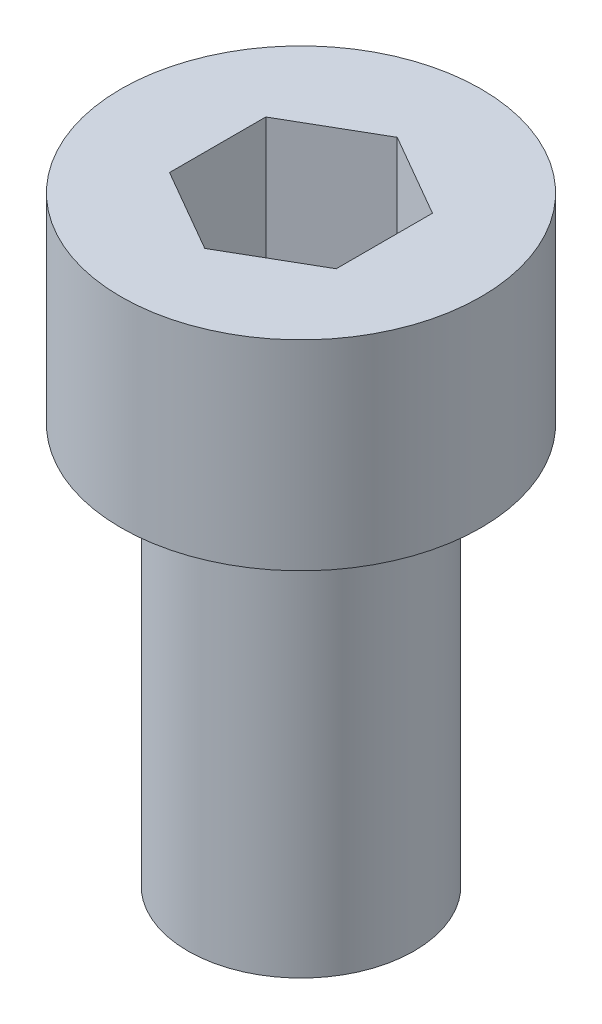
ISO-10303-21;
HEADER;
FILE_DESCRIPTION(('STEP AP214'),'2;1');
FILE_NAME('part.step','',(''),(''),'','','');
FILE_SCHEMA(('AUTOMOTIVE_DESIGN { 1 0 10303 214 1 1 1 1 }'));
ENDSEC;
DATA;
#1=APPLICATION_CONTEXT('core data for automotive mechanical design processes');
#2=APPLICATION_PROTOCOL_DEFINITION('international standard','automotive_design',2000,#1);
#3=PRODUCT_CONTEXT('',#1,'mechanical');
#4=PRODUCT('Part','Part','',(#3));
#5=PRODUCT_RELATED_PRODUCT_CATEGORY('part','',(#4));
#6=PRODUCT_DEFINITION_FORMATION('','',#4);
#7=PRODUCT_DEFINITION_CONTEXT('part definition',#1,'design');
#8=PRODUCT_DEFINITION('design','',#6,#7);
#9=PRODUCT_DEFINITION_SHAPE('','',#8);
#10=(LENGTH_UNIT() NAMED_UNIT(*) SI_UNIT(.MILLI.,.METRE.));
#11=(NAMED_UNIT(*) PLANE_ANGLE_UNIT() SI_UNIT($,.RADIAN.));
#12=(NAMED_UNIT(*) SI_UNIT($,.STERADIAN.) SOLID_ANGLE_UNIT());
#13=UNCERTAINTY_MEASURE_WITH_UNIT(LENGTH_MEASURE(1.E-05),#10,'distance_accuracy_value','');
#14=(GEOMETRIC_REPRESENTATION_CONTEXT(3) GLOBAL_UNCERTAINTY_ASSIGNED_CONTEXT((#13)) GLOBAL_UNIT_ASSIGNED_CONTEXT((#10,
#11,#12)) REPRESENTATION_CONTEXT('',''));
#15=CARTESIAN_POINT('',(0.,0.,0.));
#16=DIRECTION('',(0.,0.,1.));
#17=DIRECTION('',(1.,0.,0.));
#18=AXIS2_PLACEMENT_3D('',#15,#16,#17);
#19=CARTESIAN_POINT('',(184.714490271524,-3.,125.244295140347));
#20=DIRECTION('',(0.,1.,0.));
#21=DIRECTION('',(0.,0.,1.));
#22=AXIS2_PLACEMENT_3D('',#19,#20,#21);
#23=CYLINDRICAL_SURFACE('',#22,2.70000000000001);
#24=CARTESIAN_POINT('',(184.714490271524,-3.,125.244295140347));
#25=DIRECTION('',(0.,1.,0.));
#26=DIRECTION('',(0.,0.,1.));
#27=AXIS2_PLACEMENT_3D('',#24,#25,#26);
#28=CIRCLE('',#27,2.70000000000001);
#29=CARTESIAN_POINT('',(184.714490271524,-3.,127.944295140347));
#30=VERTEX_POINT('',#29);
#31=EDGE_CURVE('E48',#30,#30,#28,.T.);
#32=ORIENTED_EDGE('',*,*,#31,.T.);
#33=EDGE_LOOP('',(#32));
#34=FACE_BOUND('',#33,.T.);
#35=CARTESIAN_POINT('',(184.714490271524,0.,125.244295140347));
#36=DIRECTION('',(0.,1.,0.));
#37=DIRECTION('',(0.,0.,1.));
#38=AXIS2_PLACEMENT_3D('',#35,#36,#37);
#39=CIRCLE('',#38,2.70000000000001);
#40=CARTESIAN_POINT('',(184.714490271524,0.,127.944295140347));
#41=VERTEX_POINT('',#40);
#42=EDGE_CURVE('E42',#41,#41,#39,.T.);
#43=ORIENTED_EDGE('',*,*,#42,.F.);
#44=EDGE_LOOP('',(#43));
#45=FACE_BOUND('',#44,.T.);
#46=ADVANCED_FACE('F39',(#34,#45),#23,.T.);
#47=CARTESIAN_POINT('',(184.714490271524,-3.,125.244295140347));
#48=DIRECTION('',(0.,1.,0.));
#49=DIRECTION('',(0.,0.,1.));
#50=AXIS2_PLACEMENT_3D('',#47,#48,#49);
#51=PLANE('',#50);
#52=CARTESIAN_POINT('',(184.714490271524,-3.,125.244295140347));
#53=DIRECTION('',(0.,-1.,0.));
#54=DIRECTION('',(0.,0.,-1.));
#55=AXIS2_PLACEMENT_3D('',#52,#53,#54);
#56=CIRCLE('',#55,1.69629374220996);
#57=CARTESIAN_POINT('',(184.714490271524,-3.,123.548001398137));
#58=VERTEX_POINT('',#57);
#59=EDGE_CURVE('E11',#58,#58,#56,.T.);
#60=ORIENTED_EDGE('',*,*,#59,.F.);
#61=EDGE_LOOP('',(#60));
#62=FACE_BOUND('',#61,.T.);
#63=ORIENTED_EDGE('',*,*,#31,.F.);
#64=EDGE_LOOP('',(#63));
#65=FACE_BOUND('',#64,.T.);
#66=ADVANCED_FACE('F178',(#62,#65),#51,.F.);
#67=CARTESIAN_POINT('',(184.714490271524,0.,125.244295140347));
#68=DIRECTION('',(0.,1.,0.));
#69=DIRECTION('',(0.,0.,1.));
#70=AXIS2_PLACEMENT_3D('',#67,#68,#69);
#71=PLANE('',#70);
#72=DIRECTION('',(-0.866025403784435,0.,-0.500000000000006));
#73=VECTOR('',#72,1.);
#74=CARTESIAN_POINT('',(185.964490271524,0.,124.52260730386));
#75=LINE('',#74,#73);
#76=CARTESIAN_POINT('',(185.964490271524,0.,124.52260730386));
#77=VERTEX_POINT('',#76);
#78=CARTESIAN_POINT('',(184.714490271524,0.,123.800919467373));
#79=VERTEX_POINT('',#78);
#80=EDGE_CURVE('E56',#77,#79,#75,.T.);
#81=ORIENTED_EDGE('',*,*,#80,.F.);
#82=DIRECTION('',(0.,0.,-1.));
#83=VECTOR('',#82,1.);
#84=CARTESIAN_POINT('',(185.964490271524,0.,125.965982976834));
#85=LINE('',#84,#83);
#86=CARTESIAN_POINT('',(185.964490271524,0.,125.965982976834));
#87=VERTEX_POINT('',#86);
#88=EDGE_CURVE('E149',#87,#77,#85,.T.);
#89=ORIENTED_EDGE('',*,*,#88,.F.);
#90=DIRECTION('',(0.86602540378443,0.,-0.500000000000015));
#91=VECTOR('',#90,1.);
#92=CARTESIAN_POINT('',(184.714490271524,0.,126.687670813321));
#93=LINE('',#92,#91);
#94=CARTESIAN_POINT('',(184.714490271524,0.,126.687670813321));
#95=VERTEX_POINT('',#94);
#96=EDGE_CURVE('E146',#95,#87,#93,.T.);
#97=ORIENTED_EDGE('',*,*,#96,.F.);
#98=DIRECTION('',(0.866025403784436,0.,0.500000000000004));
#99=VECTOR('',#98,1.);
#100=CARTESIAN_POINT('',(183.464490271524,0.,125.965982976834));
#101=LINE('',#100,#99);
#102=CARTESIAN_POINT('',(183.464490271524,0.,125.965982976834));
#103=VERTEX_POINT('',#102);
#104=EDGE_CURVE('E104',#103,#95,#101,.T.);
#105=ORIENTED_EDGE('',*,*,#104,.F.);
#106=DIRECTION('',(0.,0.,1.));
#107=VECTOR('',#106,1.);
#108=CARTESIAN_POINT('',(183.464490271524,0.,124.52260730386));
#109=LINE('',#108,#107);
#110=CARTESIAN_POINT('',(183.464490271524,0.,124.52260730386));
#111=VERTEX_POINT('',#110);
#112=EDGE_CURVE('E140',#111,#103,#109,.T.);
#113=ORIENTED_EDGE('',*,*,#112,.F.);
#114=DIRECTION('',(-0.86602540378444,0.,0.499999999999998));
#115=VECTOR('',#114,1.);
#116=CARTESIAN_POINT('',(184.714490271524,0.,123.800919467373));
#117=LINE('',#116,#115);
#118=EDGE_CURVE('E136',#79,#111,#117,.T.);
#119=ORIENTED_EDGE('',*,*,#118,.F.);
#120=EDGE_LOOP('',(#81,#89,#97,#105,#113,#119));
#121=FACE_BOUND('',#120,.T.);
#122=ORIENTED_EDGE('',*,*,#42,.T.);
#123=EDGE_LOOP('',(#122));
#124=FACE_BOUND('',#123,.T.);
#125=ADVANCED_FACE('F175',(#121,#124),#71,.T.);
#126=CARTESIAN_POINT('',(184.714490271524,-9.,125.244295140347));
#127=DIRECTION('',(0.,1.,0.));
#128=DIRECTION('',(0.,0.,1.));
#129=AXIS2_PLACEMENT_3D('',#126,#127,#128);
#130=CYLINDRICAL_SURFACE('',#129,1.69629374220996);
#131=CARTESIAN_POINT('',(184.714490271524,-9.,125.244295140347));
#132=DIRECTION('',(0.,-1.,0.));
#133=DIRECTION('',(0.,0.,-1.));
#134=AXIS2_PLACEMENT_3D('',#131,#132,#133);
#135=CIRCLE('',#134,1.69629374220996);
#136=CARTESIAN_POINT('',(184.714490271524,-9.,123.548001398137));
#137=VERTEX_POINT('',#136);
#138=EDGE_CURVE('E155',#137,#137,#135,.T.);
#139=ORIENTED_EDGE('',*,*,#138,.F.);
#140=EDGE_LOOP('',(#139));
#141=FACE_BOUND('',#140,.T.);
#142=ORIENTED_EDGE('',*,*,#59,.T.);
#143=EDGE_LOOP('',(#142));
#144=FACE_BOUND('',#143,.T.);
#145=ADVANCED_FACE('F187',(#141,#144),#130,.T.);
#146=CARTESIAN_POINT('',(184.714490271524,-9.,125.244295140347));
#147=DIRECTION('',(0.,-1.,0.));
#148=DIRECTION('',(0.,0.,-1.));
#149=AXIS2_PLACEMENT_3D('',#146,#147,#148);
#150=PLANE('',#149);
#151=ORIENTED_EDGE('',*,*,#138,.T.);
#152=EDGE_LOOP('',(#151));
#153=FACE_BOUND('',#152,.T.);
#154=ADVANCED_FACE('F194',(#153),#150,.T.);
#155=CARTESIAN_POINT('',(185.964490271524,-2.,124.52260730386));
#156=DIRECTION('',(0.500000000000006,0.,-0.866025403784435));
#157=DIRECTION('',(-0.866025403784435,0.,-0.500000000000006));
#158=AXIS2_PLACEMENT_3D('',#155,#156,#157);
#159=PLANE('',#158);
#160=ORIENTED_EDGE('',*,*,#80,.T.);
#161=DIRECTION('',(0.,1.,0.));
#162=VECTOR('',#161,1.);
#163=CARTESIAN_POINT('',(184.714490271524,-2.,123.800919467373));
#164=LINE('',#163,#162);
#165=CARTESIAN_POINT('',(184.714490271524,-2.,123.800919467373));
#166=VERTEX_POINT('',#165);
#167=EDGE_CURVE('E86',#166,#79,#164,.T.);
#168=ORIENTED_EDGE('',*,*,#167,.F.);
#169=DIRECTION('',(-0.866025403784435,0.,-0.500000000000006));
#170=VECTOR('',#169,1.);
#171=CARTESIAN_POINT('',(185.964490271524,-2.,124.52260730386));
#172=LINE('',#171,#170);
#173=CARTESIAN_POINT('',(185.964490271524,-2.,124.52260730386));
#174=VERTEX_POINT('',#173);
#175=EDGE_CURVE('E152',#174,#166,#172,.T.);
#176=ORIENTED_EDGE('',*,*,#175,.F.);
#177=DIRECTION('',(0.,1.,0.));
#178=VECTOR('',#177,1.);
#179=CARTESIAN_POINT('',(185.964490271524,-2.,124.52260730386));
#180=LINE('',#179,#178);
#181=EDGE_CURVE('E64',#174,#77,#180,.T.);
#182=ORIENTED_EDGE('',*,*,#181,.T.);
#183=EDGE_LOOP('',(#160,#168,#176,#182));
#184=FACE_BOUND('',#183,.T.);
#185=ADVANCED_FACE('F198',(#184),#159,.F.);
#186=CARTESIAN_POINT('',(185.964490271524,-2.,125.965982976834));
#187=DIRECTION('',(1.,0.,0.));
#188=DIRECTION('',(0.,0.,-1.));
#189=AXIS2_PLACEMENT_3D('',#186,#187,#188);
#190=PLANE('',#189);
#191=ORIENTED_EDGE('',*,*,#88,.T.);
#192=ORIENTED_EDGE('',*,*,#181,.F.);
#193=DIRECTION('',(0.,0.,-1.));
#194=VECTOR('',#193,1.);
#195=CARTESIAN_POINT('',(185.964490271524,-2.,125.965982976834));
#196=LINE('',#195,#194);
#197=CARTESIAN_POINT('',(185.964490271524,-2.,125.965982976834));
#198=VERTEX_POINT('',#197);
#199=EDGE_CURVE('E118',#198,#174,#196,.T.);
#200=ORIENTED_EDGE('',*,*,#199,.F.);
#201=DIRECTION('',(0.,1.,0.));
#202=VECTOR('',#201,1.);
#203=CARTESIAN_POINT('',(185.964490271524,-2.,125.965982976834));
#204=LINE('',#203,#202);
#205=EDGE_CURVE('E109',#198,#87,#204,.T.);
#206=ORIENTED_EDGE('',*,*,#205,.T.);
#207=EDGE_LOOP('',(#191,#192,#200,#206));
#208=FACE_BOUND('',#207,.T.);
#209=ADVANCED_FACE('F202',(#208),#190,.F.);
#210=CARTESIAN_POINT('',(184.714490271524,-2.,126.687670813321));
#211=DIRECTION('',(0.500000000000015,0.,0.86602540378443));
#212=DIRECTION('',(0.86602540378443,0.,-0.500000000000015));
#213=AXIS2_PLACEMENT_3D('',#210,#211,#212);
#214=PLANE('',#213);
#215=ORIENTED_EDGE('',*,*,#96,.T.);
#216=ORIENTED_EDGE('',*,*,#205,.F.);
#217=DIRECTION('',(0.86602540378443,0.,-0.500000000000015));
#218=VECTOR('',#217,1.);
#219=CARTESIAN_POINT('',(184.714490271524,-2.,126.687670813321));
#220=LINE('',#219,#218);
#221=CARTESIAN_POINT('',(184.714490271524,-2.,126.687670813321));
#222=VERTEX_POINT('',#221);
#223=EDGE_CURVE('E113',#222,#198,#220,.T.);
#224=ORIENTED_EDGE('',*,*,#223,.F.);
#225=DIRECTION('',(0.,1.,0.));
#226=VECTOR('',#225,1.);
#227=CARTESIAN_POINT('',(184.714490271524,-2.,126.687670813321));
#228=LINE('',#227,#226);
#229=EDGE_CURVE('E97',#222,#95,#228,.T.);
#230=ORIENTED_EDGE('',*,*,#229,.T.);
#231=EDGE_LOOP('',(#215,#216,#224,#230));
#232=FACE_BOUND('',#231,.T.);
#233=ADVANCED_FACE('F114',(#232),#214,.F.);
#234=CARTESIAN_POINT('',(183.464490271524,-2.,125.965982976834));
#235=DIRECTION('',(-0.500000000000004,0.,0.866025403784436));
#236=DIRECTION('',(0.866025403784436,0.,0.500000000000004));
#237=AXIS2_PLACEMENT_3D('',#234,#235,#236);
#238=PLANE('',#237);
#239=ORIENTED_EDGE('',*,*,#104,.T.);
#240=ORIENTED_EDGE('',*,*,#229,.F.);
#241=DIRECTION('',(0.866025403784436,0.,0.500000000000004));
#242=VECTOR('',#241,1.);
#243=CARTESIAN_POINT('',(183.464490271524,-2.,125.965982976834));
#244=LINE('',#243,#242);
#245=CARTESIAN_POINT('',(183.464490271524,-2.,125.965982976834));
#246=VERTEX_POINT('',#245);
#247=EDGE_CURVE('E101',#246,#222,#244,.T.);
#248=ORIENTED_EDGE('',*,*,#247,.F.);
#249=DIRECTION('',(0.,1.,0.));
#250=VECTOR('',#249,1.);
#251=CARTESIAN_POINT('',(183.464490271524,-2.,125.965982976834));
#252=LINE('',#251,#250);
#253=EDGE_CURVE('E110',#246,#103,#252,.T.);
#254=ORIENTED_EDGE('',*,*,#253,.T.);
#255=EDGE_LOOP('',(#239,#240,#248,#254));
#256=FACE_BOUND('',#255,.T.);
#257=ADVANCED_FACE('F99',(#256),#238,.F.);
#258=CARTESIAN_POINT('',(183.464490271524,-2.,124.52260730386));
#259=DIRECTION('',(-1.,0.,0.));
#260=DIRECTION('',(0.,0.,1.));
#261=AXIS2_PLACEMENT_3D('',#258,#259,#260);
#262=PLANE('',#261);
#263=ORIENTED_EDGE('',*,*,#112,.T.);
#264=ORIENTED_EDGE('',*,*,#253,.F.);
#265=DIRECTION('',(0.,0.,1.));
#266=VECTOR('',#265,1.);
#267=CARTESIAN_POINT('',(183.464490271524,-2.,124.52260730386));
#268=LINE('',#267,#266);
#269=CARTESIAN_POINT('',(183.464490271524,-2.,124.52260730386));
#270=VERTEX_POINT('',#269);
#271=EDGE_CURVE('E124',#270,#246,#268,.T.);
#272=ORIENTED_EDGE('',*,*,#271,.F.);
#273=DIRECTION('',(0.,1.,0.));
#274=VECTOR('',#273,1.);
#275=CARTESIAN_POINT('',(183.464490271524,-2.,124.52260730386));
#276=LINE('',#275,#274);
#277=EDGE_CURVE('E160',#270,#111,#276,.T.);
#278=ORIENTED_EDGE('',*,*,#277,.T.);
#279=EDGE_LOOP('',(#263,#264,#272,#278));
#280=FACE_BOUND('',#279,.T.);
#281=ADVANCED_FACE('F206',(#280),#262,.F.);
#282=CARTESIAN_POINT('',(184.714490271524,-2.,123.800919467373));
#283=DIRECTION('',(-0.499999999999998,0.,-0.86602540378444));
#284=DIRECTION('',(-0.86602540378444,0.,0.499999999999998));
#285=AXIS2_PLACEMENT_3D('',#282,#283,#284);
#286=PLANE('',#285);
#287=ORIENTED_EDGE('',*,*,#118,.T.);
#288=ORIENTED_EDGE('',*,*,#277,.F.);
#289=DIRECTION('',(-0.86602540378444,0.,0.499999999999998));
#290=VECTOR('',#289,1.);
#291=CARTESIAN_POINT('',(184.714490271524,-2.,123.800919467373));
#292=LINE('',#291,#290);
#293=EDGE_CURVE('E128',#166,#270,#292,.T.);
#294=ORIENTED_EDGE('',*,*,#293,.F.);
#295=ORIENTED_EDGE('',*,*,#167,.T.);
#296=EDGE_LOOP('',(#287,#288,#294,#295));
#297=FACE_BOUND('',#296,.T.);
#298=ADVANCED_FACE('F203',(#297),#286,.F.);
#299=CARTESIAN_POINT('',(0.,-2.,0.));
#300=DIRECTION('',(0.,1.,0.));
#301=DIRECTION('',(0.,0.,1.));
#302=AXIS2_PLACEMENT_3D('',#299,#300,#301);
#303=PLANE('',#302);
#304=ORIENTED_EDGE('',*,*,#175,.T.);
#305=ORIENTED_EDGE('',*,*,#293,.T.);
#306=ORIENTED_EDGE('',*,*,#271,.T.);
#307=ORIENTED_EDGE('',*,*,#247,.T.);
#308=ORIENTED_EDGE('',*,*,#223,.T.);
#309=ORIENTED_EDGE('',*,*,#199,.T.);
#310=EDGE_LOOP('',(#304,#305,#306,#307,#308,#309));
#311=FACE_BOUND('',#310,.T.);
#312=ADVANCED_FACE('F121',(#311),#303,.T.);
#313=CLOSED_SHELL('',(#46,#66,#125,#145,#154,#185,#209,#233,#257,#281,#298,#312));
#314=MANIFOLD_SOLID_BREP('B2',#313);
#315=ADVANCED_BREP_SHAPE_REPRESENTATION('',(#18,#314),#14);
#316=SHAPE_DEFINITION_REPRESENTATION(#9,#315);
ENDSEC;
END-ISO-10303-21;
